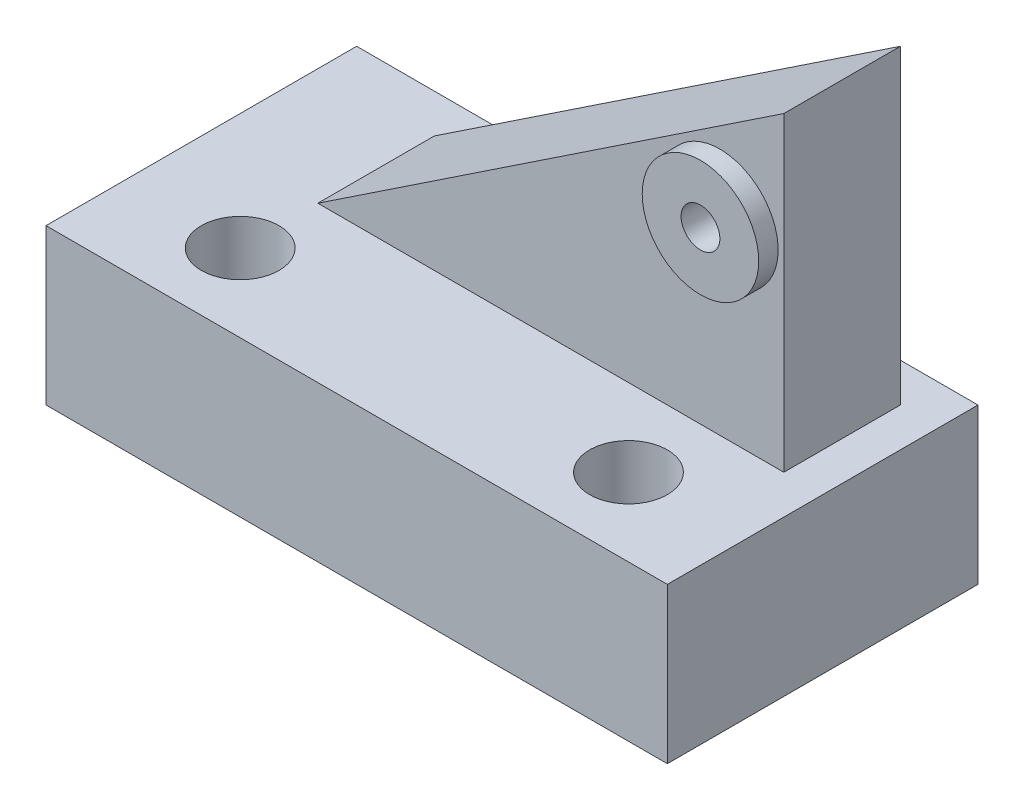
ISO-10303-21;
HEADER;
FILE_DESCRIPTION(('STEP AP214'),'2;1');
FILE_NAME('part.step','',(''),(''),'','','');
FILE_SCHEMA(('AUTOMOTIVE_DESIGN { 1 0 10303 214 1 1 1 1 }'));
ENDSEC;
DATA;
#1=APPLICATION_CONTEXT('core data for automotive mechanical design processes');
#2=APPLICATION_PROTOCOL_DEFINITION('international standard','automotive_design',2000,#1);
#3=PRODUCT_CONTEXT('',#1,'mechanical');
#4=PRODUCT('Part','Part','',(#3));
#5=PRODUCT_RELATED_PRODUCT_CATEGORY('part','',(#4));
#6=PRODUCT_DEFINITION_FORMATION('','',#4);
#7=PRODUCT_DEFINITION_CONTEXT('part definition',#1,'design');
#8=PRODUCT_DEFINITION('design','',#6,#7);
#9=PRODUCT_DEFINITION_SHAPE('','',#8);
#10=(LENGTH_UNIT() NAMED_UNIT(*) SI_UNIT(.MILLI.,.METRE.));
#11=(NAMED_UNIT(*) PLANE_ANGLE_UNIT() SI_UNIT($,.RADIAN.));
#12=(NAMED_UNIT(*) SI_UNIT($,.STERADIAN.) SOLID_ANGLE_UNIT());
#13=UNCERTAINTY_MEASURE_WITH_UNIT(LENGTH_MEASURE(1.E-05),#10,'distance_accuracy_value','');
#14=(GEOMETRIC_REPRESENTATION_CONTEXT(3) GLOBAL_UNCERTAINTY_ASSIGNED_CONTEXT((#13)) GLOBAL_UNIT_ASSIGNED_CONTEXT((#10,
#11,#12)) REPRESENTATION_CONTEXT('',''));
#15=CARTESIAN_POINT('',(0.,0.,0.));
#16=DIRECTION('',(0.,0.,1.));
#17=DIRECTION('',(1.,0.,0.));
#18=AXIS2_PLACEMENT_3D('',#15,#16,#17);
#19=CARTESIAN_POINT('',(19.05,76.2,-25.4));
#20=DIRECTION('',(0.,0.,-1.));
#21=DIRECTION('',(-1.,0.,0.));
#22=AXIS2_PLACEMENT_3D('',#19,#20,#21);
#23=PLANE('',#22);
#24=DIRECTION('',(0.,-1.,0.));
#25=VECTOR('',#24,1.);
#26=CARTESIAN_POINT('',(95.25,76.2,-25.4));
#27=LINE('',#26,#25);
#28=CARTESIAN_POINT('',(95.25,76.2,-25.4));
#29=VERTEX_POINT('',#28);
#30=CARTESIAN_POINT('',(95.25,25.4,-25.4));
#31=VERTEX_POINT('',#30);
#32=EDGE_CURVE('E102',#29,#31,#27,.T.);
#33=ORIENTED_EDGE('',*,*,#32,.F.);
#34=DIRECTION('',(0.832050294337844,0.554700196225229,0.));
#35=VECTOR('',#34,1.);
#36=CARTESIAN_POINT('',(19.05,25.4,-25.4));
#37=LINE('',#36,#35);
#38=CARTESIAN_POINT('',(19.05,25.4,-25.4));
#39=VERTEX_POINT('',#38);
#40=EDGE_CURVE('E93',#39,#29,#37,.T.);
#41=ORIENTED_EDGE('',*,*,#40,.F.);
#42=DIRECTION('',(1.,0.,0.));
#43=VECTOR('',#42,1.);
#44=CARTESIAN_POINT('',(19.05,25.4,-25.4));
#45=LINE('',#44,#43);
#46=EDGE_CURVE('E97',#39,#31,#45,.T.);
#47=ORIENTED_EDGE('',*,*,#46,.T.);
#48=EDGE_LOOP('',(#33,#41,#47));
#49=FACE_BOUND('',#48,.T.);
#50=CARTESIAN_POINT('',(84.7915721720938,56.4163177070043,-25.4));
#51=DIRECTION('',(0.,0.,-1.));
#52=DIRECTION('',(-1.,0.,0.));
#53=AXIS2_PLACEMENT_3D('',#50,#51,#52);
#54=CIRCLE('',#53,9.52500000000001);
#55=CARTESIAN_POINT('',(75.2665721720938,56.4163177070043,-25.4));
#56=VERTEX_POINT('',#55);
#57=EDGE_CURVE('E11',#56,#56,#54,.F.);
#58=ORIENTED_EDGE('',*,*,#57,.F.);
#59=EDGE_LOOP('',(#58));
#60=FACE_BOUND('',#59,.T.);
#61=ADVANCED_FACE('F33',(#49,#60),#23,.F.);
#62=CARTESIAN_POINT('',(0.,25.4,0.));
#63=DIRECTION('',(0.,-1.,0.));
#64=DIRECTION('',(0.,0.,-1.));
#65=AXIS2_PLACEMENT_3D('',#62,#63,#64);
#66=PLANE('',#65);
#67=CARTESIAN_POINT('',(82.55,25.4,-12.7));
#68=DIRECTION('',(0.,1.,0.));
#69=DIRECTION('',(0.,0.,1.));
#70=AXIS2_PLACEMENT_3D('',#67,#68,#69);
#71=CIRCLE('',#70,6.35);
#72=CARTESIAN_POINT('',(82.55,25.4,-6.35));
#73=VERTEX_POINT('',#72);
#74=EDGE_CURVE('E327',#73,#73,#71,.T.);
#75=ORIENTED_EDGE('',*,*,#74,.F.);
#76=EDGE_LOOP('',(#75));
#77=FACE_BOUND('',#76,.T.);
#78=CARTESIAN_POINT('',(19.05,25.4,-12.7));
#79=DIRECTION('',(0.,1.,0.));
#80=DIRECTION('',(0.,0.,1.));
#81=AXIS2_PLACEMENT_3D('',#78,#79,#80);
#82=CIRCLE('',#81,6.35);
#83=CARTESIAN_POINT('',(19.05,25.4,-6.35));
#84=VERTEX_POINT('',#83);
#85=EDGE_CURVE('E329',#84,#84,#82,.T.);
#86=ORIENTED_EDGE('',*,*,#85,.F.);
#87=EDGE_LOOP('',(#86));
#88=FACE_BOUND('',#87,.T.);
#89=DIRECTION('',(0.,0.,1.));
#90=VECTOR('',#89,1.);
#91=CARTESIAN_POINT('',(19.05,25.4,-25.4));
#92=LINE('',#91,#90);
#93=CARTESIAN_POINT('',(19.05,25.4,-44.45));
#94=VERTEX_POINT('',#93);
#95=EDGE_CURVE('E90',#94,#39,#92,.T.);
#96=ORIENTED_EDGE('',*,*,#95,.F.);
#97=DIRECTION('',(-1.,0.,0.));
#98=VECTOR('',#97,1.);
#99=CARTESIAN_POINT('',(19.05,25.4,-44.45));
#100=LINE('',#99,#98);
#101=CARTESIAN_POINT('',(95.25,25.4,-44.45));
#102=VERTEX_POINT('',#101);
#103=EDGE_CURVE('E53',#102,#94,#100,.T.);
#104=ORIENTED_EDGE('',*,*,#103,.F.);
#105=DIRECTION('',(0.,0.,-1.));
#106=VECTOR('',#105,1.);
#107=CARTESIAN_POINT('',(95.25,25.4,-25.4));
#108=LINE('',#107,#106);
#109=EDGE_CURVE('E48',#31,#102,#108,.T.);
#110=ORIENTED_EDGE('',*,*,#109,.F.);
#111=ORIENTED_EDGE('',*,*,#46,.F.);
#112=EDGE_LOOP('',(#96,#104,#110,#111));
#113=FACE_BOUND('',#112,.T.);
#114=DIRECTION('',(0.,0.,1.));
#115=VECTOR('',#114,1.);
#116=CARTESIAN_POINT('',(0.,25.4,0.));
#117=LINE('',#116,#115);
#118=CARTESIAN_POINT('',(0.,25.4,-50.8));
#119=VERTEX_POINT('',#118);
#120=CARTESIAN_POINT('',(0.,25.4,0.));
#121=VERTEX_POINT('',#120);
#122=EDGE_CURVE('E119',#119,#121,#117,.T.);
#123=ORIENTED_EDGE('',*,*,#122,.T.);
#124=DIRECTION('',(1.,0.,0.));
#125=VECTOR('',#124,1.);
#126=CARTESIAN_POINT('',(0.,25.4,0.));
#127=LINE('',#126,#125);
#128=CARTESIAN_POINT('',(101.6,25.4,0.));
#129=VERTEX_POINT('',#128);
#130=EDGE_CURVE('E122',#121,#129,#127,.T.);
#131=ORIENTED_EDGE('',*,*,#130,.T.);
#132=DIRECTION('',(0.,0.,-1.));
#133=VECTOR('',#132,1.);
#134=CARTESIAN_POINT('',(101.6,25.4,0.));
#135=LINE('',#134,#133);
#136=CARTESIAN_POINT('',(101.6,25.4,-50.8));
#137=VERTEX_POINT('',#136);
#138=EDGE_CURVE('E125',#129,#137,#135,.T.);
#139=ORIENTED_EDGE('',*,*,#138,.T.);
#140=DIRECTION('',(-1.,0.,0.));
#141=VECTOR('',#140,1.);
#142=CARTESIAN_POINT('',(0.,25.4,-50.8));
#143=LINE('',#142,#141);
#144=EDGE_CURVE('E127',#137,#119,#143,.T.);
#145=ORIENTED_EDGE('',*,*,#144,.T.);
#146=EDGE_LOOP('',(#123,#131,#139,#145));
#147=FACE_BOUND('',#146,.T.);
#148=ADVANCED_FACE('F106',(#77,#88,#113,#147),#66,.F.);
#149=CARTESIAN_POINT('',(0.,25.4,0.));
#150=DIRECTION('',(1.,0.,0.));
#151=DIRECTION('',(0.,0.,-1.));
#152=AXIS2_PLACEMENT_3D('',#149,#150,#151);
#153=PLANE('',#152);
#154=DIRECTION('',(0.,0.,1.));
#155=VECTOR('',#154,1.);
#156=CARTESIAN_POINT('',(0.,0.,0.));
#157=LINE('',#156,#155);
#158=CARTESIAN_POINT('',(0.,0.,-50.8));
#159=VERTEX_POINT('',#158);
#160=CARTESIAN_POINT('',(0.,0.,0.));
#161=VERTEX_POINT('',#160);
#162=EDGE_CURVE('E118',#159,#161,#157,.T.);
#163=ORIENTED_EDGE('',*,*,#162,.T.);
#164=DIRECTION('',(0.,-1.,0.));
#165=VECTOR('',#164,1.);
#166=CARTESIAN_POINT('',(0.,25.4,0.));
#167=LINE('',#166,#165);
#168=EDGE_CURVE('E41',#121,#161,#167,.T.);
#169=ORIENTED_EDGE('',*,*,#168,.F.);
#170=ORIENTED_EDGE('',*,*,#122,.F.);
#171=DIRECTION('',(0.,-1.,0.));
#172=VECTOR('',#171,1.);
#173=CARTESIAN_POINT('',(0.,25.4,-50.8));
#174=LINE('',#173,#172);
#175=EDGE_CURVE('E129',#119,#159,#174,.T.);
#176=ORIENTED_EDGE('',*,*,#175,.T.);
#177=EDGE_LOOP('',(#163,#169,#170,#176));
#178=FACE_BOUND('',#177,.T.);
#179=ADVANCED_FACE('F35',(#178),#153,.F.);
#180=CARTESIAN_POINT('',(0.,25.4,0.));
#181=DIRECTION('',(0.,0.,-1.));
#182=DIRECTION('',(-1.,0.,0.));
#183=AXIS2_PLACEMENT_3D('',#180,#181,#182);
#184=PLANE('',#183);
#185=DIRECTION('',(1.,0.,0.));
#186=VECTOR('',#185,1.);
#187=CARTESIAN_POINT('',(0.,0.,0.));
#188=LINE('',#187,#186);
#189=CARTESIAN_POINT('',(101.6,0.,0.));
#190=VERTEX_POINT('',#189);
#191=EDGE_CURVE('E132',#161,#190,#188,.T.);
#192=ORIENTED_EDGE('',*,*,#191,.T.);
#193=DIRECTION('',(0.,-1.,0.));
#194=VECTOR('',#193,1.);
#195=CARTESIAN_POINT('',(101.6,25.4,0.));
#196=LINE('',#195,#194);
#197=EDGE_CURVE('E142',#129,#190,#196,.T.);
#198=ORIENTED_EDGE('',*,*,#197,.F.);
#199=ORIENTED_EDGE('',*,*,#130,.F.);
#200=ORIENTED_EDGE('',*,*,#168,.T.);
#201=EDGE_LOOP('',(#192,#198,#199,#200));
#202=FACE_BOUND('',#201,.T.);
#203=ADVANCED_FACE('F189',(#202),#184,.F.);
#204=CARTESIAN_POINT('',(101.6,25.4,0.));
#205=DIRECTION('',(-1.,0.,0.));
#206=DIRECTION('',(0.,0.,1.));
#207=AXIS2_PLACEMENT_3D('',#204,#205,#206);
#208=PLANE('',#207);
#209=DIRECTION('',(0.,0.,-1.));
#210=VECTOR('',#209,1.);
#211=CARTESIAN_POINT('',(101.6,0.,0.));
#212=LINE('',#211,#210);
#213=CARTESIAN_POINT('',(101.6,0.,-50.8));
#214=VERTEX_POINT('',#213);
#215=EDGE_CURVE('E134',#190,#214,#212,.T.);
#216=ORIENTED_EDGE('',*,*,#215,.T.);
#217=DIRECTION('',(0.,-1.,0.));
#218=VECTOR('',#217,1.);
#219=CARTESIAN_POINT('',(101.6,25.4,-50.8));
#220=LINE('',#219,#218);
#221=EDGE_CURVE('E139',#137,#214,#220,.T.);
#222=ORIENTED_EDGE('',*,*,#221,.F.);
#223=ORIENTED_EDGE('',*,*,#138,.F.);
#224=ORIENTED_EDGE('',*,*,#197,.T.);
#225=EDGE_LOOP('',(#216,#222,#223,#224));
#226=FACE_BOUND('',#225,.T.);
#227=ADVANCED_FACE('F186',(#226),#208,.F.);
#228=CARTESIAN_POINT('',(0.,25.4,-50.8));
#229=DIRECTION('',(0.,0.,1.));
#230=DIRECTION('',(1.,0.,0.));
#231=AXIS2_PLACEMENT_3D('',#228,#229,#230);
#232=PLANE('',#231);
#233=DIRECTION('',(-1.,0.,0.));
#234=VECTOR('',#233,1.);
#235=CARTESIAN_POINT('',(0.,0.,-50.8));
#236=LINE('',#235,#234);
#237=EDGE_CURVE('E123',#214,#159,#236,.T.);
#238=ORIENTED_EDGE('',*,*,#237,.T.);
#239=ORIENTED_EDGE('',*,*,#175,.F.);
#240=ORIENTED_EDGE('',*,*,#144,.F.);
#241=ORIENTED_EDGE('',*,*,#221,.T.);
#242=EDGE_LOOP('',(#238,#239,#240,#241));
#243=FACE_BOUND('',#242,.T.);
#244=ADVANCED_FACE('F173',(#243),#232,.F.);
#245=CARTESIAN_POINT('',(0.,0.,0.));
#246=DIRECTION('',(0.,-1.,0.));
#247=DIRECTION('',(0.,0.,-1.));
#248=AXIS2_PLACEMENT_3D('',#245,#246,#247);
#249=PLANE('',#248);
#250=CARTESIAN_POINT('',(82.55,0.,-12.7));
#251=DIRECTION('',(0.,1.,0.));
#252=DIRECTION('',(0.,0.,1.));
#253=AXIS2_PLACEMENT_3D('',#250,#251,#252);
#254=CIRCLE('',#253,6.35);
#255=CARTESIAN_POINT('',(82.55,0.,-6.35));
#256=VERTEX_POINT('',#255);
#257=EDGE_CURVE('E324',#256,#256,#254,.T.);
#258=ORIENTED_EDGE('',*,*,#257,.T.);
#259=EDGE_LOOP('',(#258));
#260=FACE_BOUND('',#259,.T.);
#261=CARTESIAN_POINT('',(19.05,0.,-12.7));
#262=DIRECTION('',(0.,1.,0.));
#263=DIRECTION('',(0.,0.,1.));
#264=AXIS2_PLACEMENT_3D('',#261,#262,#263);
#265=CIRCLE('',#264,6.35);
#266=CARTESIAN_POINT('',(19.05,0.,-6.35));
#267=VERTEX_POINT('',#266);
#268=EDGE_CURVE('E156',#267,#267,#265,.T.);
#269=ORIENTED_EDGE('',*,*,#268,.T.);
#270=EDGE_LOOP('',(#269));
#271=FACE_BOUND('',#270,.T.);
#272=ORIENTED_EDGE('',*,*,#162,.F.);
#273=ORIENTED_EDGE('',*,*,#237,.F.);
#274=ORIENTED_EDGE('',*,*,#215,.F.);
#275=ORIENTED_EDGE('',*,*,#191,.F.);
#276=EDGE_LOOP('',(#272,#273,#274,#275));
#277=FACE_BOUND('',#276,.T.);
#278=ADVANCED_FACE('F166',(#260,#271,#277),#249,.T.);
#279=CARTESIAN_POINT('',(95.25,76.2,-25.4));
#280=DIRECTION('',(-1.,0.,0.));
#281=DIRECTION('',(0.,0.,1.));
#282=AXIS2_PLACEMENT_3D('',#279,#280,#281);
#283=PLANE('',#282);
#284=ORIENTED_EDGE('',*,*,#109,.T.);
#285=DIRECTION('',(0.,-1.,0.));
#286=VECTOR('',#285,1.);
#287=CARTESIAN_POINT('',(95.25,76.2,-44.45));
#288=LINE('',#287,#286);
#289=CARTESIAN_POINT('',(95.25,76.2,-44.45));
#290=VERTEX_POINT('',#289);
#291=EDGE_CURVE('E114',#290,#102,#288,.T.);
#292=ORIENTED_EDGE('',*,*,#291,.F.);
#293=DIRECTION('',(0.,0.,-1.));
#294=VECTOR('',#293,1.);
#295=CARTESIAN_POINT('',(95.25,76.2,-25.4));
#296=LINE('',#295,#294);
#297=EDGE_CURVE('E113',#29,#290,#296,.T.);
#298=ORIENTED_EDGE('',*,*,#297,.F.);
#299=ORIENTED_EDGE('',*,*,#32,.T.);
#300=EDGE_LOOP('',(#284,#292,#298,#299));
#301=FACE_BOUND('',#300,.T.);
#302=ADVANCED_FACE('F164',(#301),#283,.F.);
#303=CARTESIAN_POINT('',(19.05,76.2,-44.45));
#304=DIRECTION('',(0.,0.,1.));
#305=DIRECTION('',(1.,0.,0.));
#306=AXIS2_PLACEMENT_3D('',#303,#304,#305);
#307=PLANE('',#306);
#308=CARTESIAN_POINT('',(84.7915721720938,56.4163177070043,-44.45));
#309=DIRECTION('',(0.,0.,1.));
#310=DIRECTION('',(1.,0.,0.));
#311=AXIS2_PLACEMENT_3D('',#308,#309,#310);
#312=CIRCLE('',#311,3.175);
#313=CARTESIAN_POINT('',(87.9665721720938,56.4163177070043,-44.45));
#314=VERTEX_POINT('',#313);
#315=EDGE_CURVE('E104',#314,#314,#312,.T.);
#316=ORIENTED_EDGE('',*,*,#315,.T.);
#317=EDGE_LOOP('',(#316));
#318=FACE_BOUND('',#317,.T.);
#319=ORIENTED_EDGE('',*,*,#103,.T.);
#320=DIRECTION('',(0.832050294337844,0.554700196225229,0.));
#321=VECTOR('',#320,1.);
#322=CARTESIAN_POINT('',(42.4961538461538,41.0307692307692,-44.45));
#323=LINE('',#322,#321);
#324=EDGE_CURVE('E96',#94,#290,#323,.T.);
#325=ORIENTED_EDGE('',*,*,#324,.T.);
#326=ORIENTED_EDGE('',*,*,#291,.T.);
#327=EDGE_LOOP('',(#319,#325,#326));
#328=FACE_BOUND('',#327,.T.);
#329=ADVANCED_FACE('F163',(#318,#328),#307,.F.);
#330=CARTESIAN_POINT('',(19.05,25.4,-50.8));
#331=DIRECTION('',(0.554700196225229,-0.832050294337844,0.));
#332=DIRECTION('',(0.832050294337844,0.554700196225229,0.));
#333=AXIS2_PLACEMENT_3D('',#330,#331,#332);
#334=PLANE('',#333);
#335=ORIENTED_EDGE('',*,*,#95,.T.);
#336=ORIENTED_EDGE('',*,*,#40,.T.);
#337=ORIENTED_EDGE('',*,*,#297,.T.);
#338=ORIENTED_EDGE('',*,*,#324,.F.);
#339=EDGE_LOOP('',(#335,#336,#337,#338));
#340=FACE_BOUND('',#339,.T.);
#341=ADVANCED_FACE('F92',(#340),#334,.F.);
#342=CARTESIAN_POINT('',(84.7915721720938,56.4163177070043,-50.8));
#343=DIRECTION('',(0.,0.,1.));
#344=DIRECTION('',(1.,0.,0.));
#345=AXIS2_PLACEMENT_3D('',#342,#343,#344);
#346=CYLINDRICAL_SURFACE('',#345,3.175);
#347=ORIENTED_EDGE('',*,*,#315,.F.);
#348=EDGE_LOOP('',(#347));
#349=FACE_BOUND('',#348,.T.);
#350=CARTESIAN_POINT('',(84.7915721720938,56.4163177070043,-22.225));
#351=DIRECTION('',(0.,0.,1.));
#352=DIRECTION('',(1.,0.,0.));
#353=AXIS2_PLACEMENT_3D('',#350,#351,#352);
#354=CIRCLE('',#353,3.175);
#355=CARTESIAN_POINT('',(87.9665721720938,56.4163177070043,-22.225));
#356=VERTEX_POINT('',#355);
#357=EDGE_CURVE('E151',#356,#356,#354,.T.);
#358=ORIENTED_EDGE('',*,*,#357,.T.);
#359=EDGE_LOOP('',(#358));
#360=FACE_BOUND('',#359,.T.);
#361=ADVANCED_FACE('F258',(#349,#360),#346,.F.);
#362=CARTESIAN_POINT('',(84.7915721720938,56.4163177070043,-22.225));
#363=DIRECTION('',(0.,0.,1.));
#364=DIRECTION('',(1.,0.,0.));
#365=AXIS2_PLACEMENT_3D('',#362,#363,#364);
#366=PLANE('',#365);
#367=CARTESIAN_POINT('',(84.7915721720938,56.4163177070043,-22.225));
#368=DIRECTION('',(0.,0.,1.));
#369=DIRECTION('',(1.,0.,0.));
#370=AXIS2_PLACEMENT_3D('',#367,#368,#369);
#371=CIRCLE('',#370,9.52500000000001);
#372=CARTESIAN_POINT('',(94.3165721720938,56.4163177070043,-22.225));
#373=VERTEX_POINT('',#372);
#374=EDGE_CURVE('E147',#373,#373,#371,.T.);
#375=ORIENTED_EDGE('',*,*,#374,.T.);
#376=EDGE_LOOP('',(#375));
#377=FACE_BOUND('',#376,.T.);
#378=ORIENTED_EDGE('',*,*,#357,.F.);
#379=EDGE_LOOP('',(#378));
#380=FACE_BOUND('',#379,.T.);
#381=ADVANCED_FACE('F255',(#377,#380),#366,.T.);
#382=CARTESIAN_POINT('',(84.7915721720938,56.4163177070043,-22.225));
#383=DIRECTION('',(0.,0.,-1.));
#384=DIRECTION('',(-1.,0.,0.));
#385=AXIS2_PLACEMENT_3D('',#382,#383,#384);
#386=CYLINDRICAL_SURFACE('',#385,9.52500000000001);
#387=ORIENTED_EDGE('',*,*,#374,.F.);
#388=EDGE_LOOP('',(#387));
#389=FACE_BOUND('',#388,.T.);
#390=ORIENTED_EDGE('',*,*,#57,.T.);
#391=EDGE_LOOP('',(#390));
#392=FACE_BOUND('',#391,.T.);
#393=ADVANCED_FACE('F222',(#389,#392),#386,.T.);
#394=CARTESIAN_POINT('',(19.05,0.,-12.7));
#395=DIRECTION('',(0.,1.,0.));
#396=DIRECTION('',(0.,0.,1.));
#397=AXIS2_PLACEMENT_3D('',#394,#395,#396);
#398=CYLINDRICAL_SURFACE('',#397,6.35);
#399=ORIENTED_EDGE('',*,*,#268,.F.);
#400=EDGE_LOOP('',(#399));
#401=FACE_BOUND('',#400,.T.);
#402=ORIENTED_EDGE('',*,*,#85,.T.);
#403=EDGE_LOOP('',(#402));
#404=FACE_BOUND('',#403,.T.);
#405=ADVANCED_FACE('F233',(#401,#404),#398,.F.);
#406=CARTESIAN_POINT('',(82.55,0.,-12.7));
#407=DIRECTION('',(0.,1.,0.));
#408=DIRECTION('',(0.,0.,1.));
#409=AXIS2_PLACEMENT_3D('',#406,#407,#408);
#410=CYLINDRICAL_SURFACE('',#409,6.35);
#411=ORIENTED_EDGE('',*,*,#257,.F.);
#412=EDGE_LOOP('',(#411));
#413=FACE_BOUND('',#412,.T.);
#414=ORIENTED_EDGE('',*,*,#74,.T.);
#415=EDGE_LOOP('',(#414));
#416=FACE_BOUND('',#415,.T.);
#417=ADVANCED_FACE('F238',(#413,#416),#410,.F.);
#418=CLOSED_SHELL('',(#61,#148,#179,#203,#227,#244,#278,#302,#329,#341,#361,#381,#393,#405,#417));
#419=MANIFOLD_SOLID_BREP('B2',#418);
#420=ADVANCED_BREP_SHAPE_REPRESENTATION('',(#18,#419),#14);
#421=SHAPE_DEFINITION_REPRESENTATION(#9,#420);
ENDSEC;
END-ISO-10303-21;
